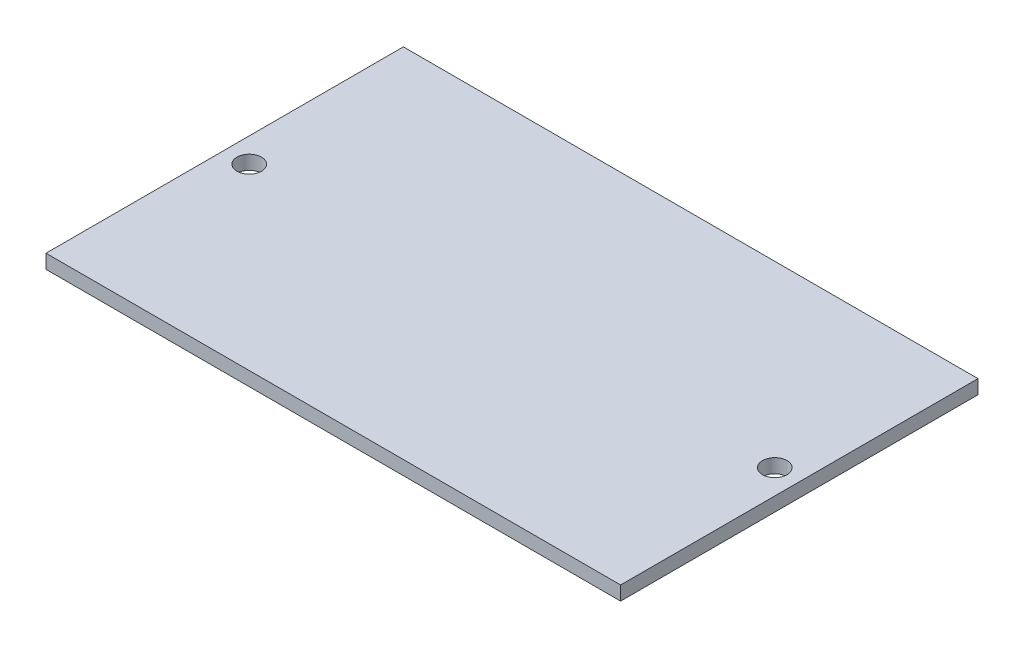
ISO-10303-21;
HEADER;
FILE_DESCRIPTION(('STEP AP214'),'2;1');
FILE_NAME('part.step','',(''),(''),'','','');
FILE_SCHEMA(('AUTOMOTIVE_DESIGN { 1 0 10303 214 1 1 1 1 }'));
ENDSEC;
DATA;
#1=APPLICATION_CONTEXT('core data for automotive mechanical design processes');
#2=APPLICATION_PROTOCOL_DEFINITION('international standard','automotive_design',2000,#1);
#3=PRODUCT_CONTEXT('',#1,'mechanical');
#4=PRODUCT('Part','Part','',(#3));
#5=PRODUCT_RELATED_PRODUCT_CATEGORY('part','',(#4));
#6=PRODUCT_DEFINITION_FORMATION('','',#4);
#7=PRODUCT_DEFINITION_CONTEXT('part definition',#1,'design');
#8=PRODUCT_DEFINITION('design','',#6,#7);
#9=PRODUCT_DEFINITION_SHAPE('','',#8);
#10=(LENGTH_UNIT() NAMED_UNIT(*) SI_UNIT(.MILLI.,.METRE.));
#11=(NAMED_UNIT(*) PLANE_ANGLE_UNIT() SI_UNIT($,.RADIAN.));
#12=(NAMED_UNIT(*) SI_UNIT($,.STERADIAN.) SOLID_ANGLE_UNIT());
#13=UNCERTAINTY_MEASURE_WITH_UNIT(LENGTH_MEASURE(1.E-05),#10,'distance_accuracy_value','');
#14=(GEOMETRIC_REPRESENTATION_CONTEXT(3) GLOBAL_UNCERTAINTY_ASSIGNED_CONTEXT((#13)) GLOBAL_UNIT_ASSIGNED_CONTEXT((#10,
#11,#12)) REPRESENTATION_CONTEXT('',''));
#15=CARTESIAN_POINT('',(0.,0.,0.));
#16=DIRECTION('',(0.,0.,1.));
#17=DIRECTION('',(1.,0.,0.));
#18=AXIS2_PLACEMENT_3D('',#15,#16,#17);
#19=CARTESIAN_POINT('',(0.,2.,0.));
#20=DIRECTION('',(1.,0.,0.));
#21=DIRECTION('',(0.,0.,-1.));
#22=AXIS2_PLACEMENT_3D('',#19,#20,#21);
#23=PLANE('',#22);
#24=DIRECTION('',(0.,0.,1.));
#25=VECTOR('',#24,1.);
#26=CARTESIAN_POINT('',(0.,0.,0.));
#27=LINE('',#26,#25);
#28=CARTESIAN_POINT('',(0.,0.,-51.));
#29=VERTEX_POINT('',#28);
#30=CARTESIAN_POINT('',(0.,0.,0.));
#31=VERTEX_POINT('',#30);
#32=EDGE_CURVE('E100',#29,#31,#27,.T.);
#33=ORIENTED_EDGE('',*,*,#32,.T.);
#34=DIRECTION('',(0.,-1.,0.));
#35=VECTOR('',#34,1.);
#36=CARTESIAN_POINT('',(0.,2.,0.));
#37=LINE('',#36,#35);
#38=CARTESIAN_POINT('',(0.,2.,0.));
#39=VERTEX_POINT('',#38);
#40=EDGE_CURVE('E11',#39,#31,#37,.T.);
#41=ORIENTED_EDGE('',*,*,#40,.F.);
#42=DIRECTION('',(0.,0.,1.));
#43=VECTOR('',#42,1.);
#44=CARTESIAN_POINT('',(0.,2.,0.));
#45=LINE('',#44,#43);
#46=CARTESIAN_POINT('',(0.,2.,-51.));
#47=VERTEX_POINT('',#46);
#48=EDGE_CURVE('E88',#47,#39,#45,.T.);
#49=ORIENTED_EDGE('',*,*,#48,.F.);
#50=DIRECTION('',(0.,-1.,0.));
#51=VECTOR('',#50,1.);
#52=CARTESIAN_POINT('',(0.,2.,-51.));
#53=LINE('',#52,#51);
#54=EDGE_CURVE('E96',#47,#29,#53,.T.);
#55=ORIENTED_EDGE('',*,*,#54,.T.);
#56=EDGE_LOOP('',(#33,#41,#49,#55));
#57=FACE_BOUND('',#56,.T.);
#58=ADVANCED_FACE('F37',(#57),#23,.F.);
#59=CARTESIAN_POINT('',(0.,2.,0.));
#60=DIRECTION('',(0.,0.,-1.));
#61=DIRECTION('',(-1.,0.,0.));
#62=AXIS2_PLACEMENT_3D('',#59,#60,#61);
#63=PLANE('',#62);
#64=DIRECTION('',(1.,0.,0.));
#65=VECTOR('',#64,1.);
#66=CARTESIAN_POINT('',(0.,0.,0.));
#67=LINE('',#66,#65);
#68=CARTESIAN_POINT('',(82.,0.,0.));
#69=VERTEX_POINT('',#68);
#70=EDGE_CURVE('E92',#31,#69,#67,.T.);
#71=ORIENTED_EDGE('',*,*,#70,.T.);
#72=DIRECTION('',(0.,-1.,0.));
#73=VECTOR('',#72,1.);
#74=CARTESIAN_POINT('',(82.,2.,0.));
#75=LINE('',#74,#73);
#76=CARTESIAN_POINT('',(82.,2.,0.));
#77=VERTEX_POINT('',#76);
#78=EDGE_CURVE('E45',#77,#69,#75,.T.);
#79=ORIENTED_EDGE('',*,*,#78,.F.);
#80=DIRECTION('',(1.,0.,0.));
#81=VECTOR('',#80,1.);
#82=CARTESIAN_POINT('',(0.,2.,0.));
#83=LINE('',#82,#81);
#84=EDGE_CURVE('E83',#39,#77,#83,.T.);
#85=ORIENTED_EDGE('',*,*,#84,.F.);
#86=ORIENTED_EDGE('',*,*,#40,.T.);
#87=EDGE_LOOP('',(#71,#79,#85,#86));
#88=FACE_BOUND('',#87,.T.);
#89=ADVANCED_FACE('F91',(#88),#63,.F.);
#90=CARTESIAN_POINT('',(82.,2.,0.));
#91=DIRECTION('',(-1.,0.,0.));
#92=DIRECTION('',(0.,0.,1.));
#93=AXIS2_PLACEMENT_3D('',#90,#91,#92);
#94=PLANE('',#93);
#95=DIRECTION('',(0.,0.,-1.));
#96=VECTOR('',#95,1.);
#97=CARTESIAN_POINT('',(82.,0.,0.));
#98=LINE('',#97,#96);
#99=CARTESIAN_POINT('',(82.,0.,-51.));
#100=VERTEX_POINT('',#99);
#101=EDGE_CURVE('E70',#69,#100,#98,.T.);
#102=ORIENTED_EDGE('',*,*,#101,.T.);
#103=DIRECTION('',(0.,-1.,0.));
#104=VECTOR('',#103,1.);
#105=CARTESIAN_POINT('',(82.,2.,-51.));
#106=LINE('',#105,#104);
#107=CARTESIAN_POINT('',(82.,2.,-51.));
#108=VERTEX_POINT('',#107);
#109=EDGE_CURVE('E93',#108,#100,#106,.T.);
#110=ORIENTED_EDGE('',*,*,#109,.F.);
#111=DIRECTION('',(0.,0.,-1.));
#112=VECTOR('',#111,1.);
#113=CARTESIAN_POINT('',(82.,2.,0.));
#114=LINE('',#113,#112);
#115=EDGE_CURVE('E86',#77,#108,#114,.T.);
#116=ORIENTED_EDGE('',*,*,#115,.F.);
#117=ORIENTED_EDGE('',*,*,#78,.T.);
#118=EDGE_LOOP('',(#102,#110,#116,#117));
#119=FACE_BOUND('',#118,.T.);
#120=ADVANCED_FACE('F94',(#119),#94,.F.);
#121=CARTESIAN_POINT('',(0.,2.,-51.));
#122=DIRECTION('',(0.,0.,1.));
#123=DIRECTION('',(1.,0.,0.));
#124=AXIS2_PLACEMENT_3D('',#121,#122,#123);
#125=PLANE('',#124);
#126=DIRECTION('',(-1.,0.,0.));
#127=VECTOR('',#126,1.);
#128=CARTESIAN_POINT('',(0.,0.,-51.));
#129=LINE('',#128,#127);
#130=EDGE_CURVE('E76',#100,#29,#129,.T.);
#131=ORIENTED_EDGE('',*,*,#130,.T.);
#132=ORIENTED_EDGE('',*,*,#54,.F.);
#133=DIRECTION('',(-1.,0.,0.));
#134=VECTOR('',#133,1.);
#135=CARTESIAN_POINT('',(0.,2.,-51.));
#136=LINE('',#135,#134);
#137=EDGE_CURVE('E53',#108,#47,#136,.T.);
#138=ORIENTED_EDGE('',*,*,#137,.F.);
#139=ORIENTED_EDGE('',*,*,#109,.T.);
#140=EDGE_LOOP('',(#131,#132,#138,#139));
#141=FACE_BOUND('',#140,.T.);
#142=ADVANCED_FACE('F108',(#141),#125,.F.);
#143=CARTESIAN_POINT('',(0.,2.,0.));
#144=DIRECTION('',(0.,-1.,0.));
#145=DIRECTION('',(0.,0.,-1.));
#146=AXIS2_PLACEMENT_3D('',#143,#144,#145);
#147=PLANE('',#146);
#148=CARTESIAN_POINT('',(3.5,2.,-25.5));
#149=DIRECTION('',(0.,1.,0.));
#150=DIRECTION('',(0.,0.,1.));
#151=AXIS2_PLACEMENT_3D('',#148,#149,#150);
#152=CIRCLE('',#151,1.75);
#153=CARTESIAN_POINT('',(3.5,2.,-23.75));
#154=VERTEX_POINT('',#153);
#155=EDGE_CURVE('E120',#154,#154,#152,.T.);
#156=ORIENTED_EDGE('',*,*,#155,.F.);
#157=EDGE_LOOP('',(#156));
#158=FACE_BOUND('',#157,.T.);
#159=CARTESIAN_POINT('',(78.5,2.,-25.5));
#160=DIRECTION('',(0.,1.,0.));
#161=DIRECTION('',(0.,0.,1.));
#162=AXIS2_PLACEMENT_3D('',#159,#160,#161);
#163=CIRCLE('',#162,1.75);
#164=CARTESIAN_POINT('',(78.5,2.,-23.75));
#165=VERTEX_POINT('',#164);
#166=EDGE_CURVE('E117',#165,#165,#163,.T.);
#167=ORIENTED_EDGE('',*,*,#166,.F.);
#168=EDGE_LOOP('',(#167));
#169=FACE_BOUND('',#168,.T.);
#170=ORIENTED_EDGE('',*,*,#48,.T.);
#171=ORIENTED_EDGE('',*,*,#84,.T.);
#172=ORIENTED_EDGE('',*,*,#115,.T.);
#173=ORIENTED_EDGE('',*,*,#137,.T.);
#174=EDGE_LOOP('',(#170,#171,#172,#173));
#175=FACE_BOUND('',#174,.T.);
#176=ADVANCED_FACE('F84',(#158,#169,#175),#147,.F.);
#177=CARTESIAN_POINT('',(0.,0.,0.));
#178=DIRECTION('',(0.,-1.,0.));
#179=DIRECTION('',(0.,0.,-1.));
#180=AXIS2_PLACEMENT_3D('',#177,#178,#179);
#181=PLANE('',#180);
#182=CARTESIAN_POINT('',(3.5,0.,-25.5));
#183=DIRECTION('',(0.,1.,0.));
#184=DIRECTION('',(0.,0.,1.));
#185=AXIS2_PLACEMENT_3D('',#182,#183,#184);
#186=CIRCLE('',#185,1.75);
#187=CARTESIAN_POINT('',(3.5,0.,-23.75));
#188=VERTEX_POINT('',#187);
#189=EDGE_CURVE('E103',#188,#188,#186,.T.);
#190=ORIENTED_EDGE('',*,*,#189,.T.);
#191=EDGE_LOOP('',(#190));
#192=FACE_BOUND('',#191,.T.);
#193=CARTESIAN_POINT('',(78.5,0.,-25.5));
#194=DIRECTION('',(0.,1.,0.));
#195=DIRECTION('',(0.,0.,1.));
#196=AXIS2_PLACEMENT_3D('',#193,#194,#195);
#197=CIRCLE('',#196,1.75);
#198=CARTESIAN_POINT('',(78.5,0.,-23.75));
#199=VERTEX_POINT('',#198);
#200=EDGE_CURVE('E114',#199,#199,#197,.T.);
#201=ORIENTED_EDGE('',*,*,#200,.T.);
#202=EDGE_LOOP('',(#201));
#203=FACE_BOUND('',#202,.T.);
#204=ORIENTED_EDGE('',*,*,#32,.F.);
#205=ORIENTED_EDGE('',*,*,#130,.F.);
#206=ORIENTED_EDGE('',*,*,#101,.F.);
#207=ORIENTED_EDGE('',*,*,#70,.F.);
#208=EDGE_LOOP('',(#204,#205,#206,#207));
#209=FACE_BOUND('',#208,.T.);
#210=ADVANCED_FACE('F111',(#192,#203,#209),#181,.T.);
#211=CARTESIAN_POINT('',(78.5,0.,-25.5));
#212=DIRECTION('',(0.,1.,0.));
#213=DIRECTION('',(0.,0.,1.));
#214=AXIS2_PLACEMENT_3D('',#211,#212,#213);
#215=CYLINDRICAL_SURFACE('',#214,1.75);
#216=ORIENTED_EDGE('',*,*,#200,.F.);
#217=EDGE_LOOP('',(#216));
#218=FACE_BOUND('',#217,.T.);
#219=ORIENTED_EDGE('',*,*,#166,.T.);
#220=EDGE_LOOP('',(#219));
#221=FACE_BOUND('',#220,.T.);
#222=ADVANCED_FACE('F131',(#218,#221),#215,.F.);
#223=CARTESIAN_POINT('',(3.5,0.,-25.5));
#224=DIRECTION('',(0.,1.,0.));
#225=DIRECTION('',(0.,0.,1.));
#226=AXIS2_PLACEMENT_3D('',#223,#224,#225);
#227=CYLINDRICAL_SURFACE('',#226,1.75);
#228=ORIENTED_EDGE('',*,*,#189,.F.);
#229=EDGE_LOOP('',(#228));
#230=FACE_BOUND('',#229,.T.);
#231=ORIENTED_EDGE('',*,*,#155,.T.);
#232=EDGE_LOOP('',(#231));
#233=FACE_BOUND('',#232,.T.);
#234=ADVANCED_FACE('F128',(#230,#233),#227,.F.);
#235=CLOSED_SHELL('',(#58,#89,#120,#142,#176,#210,#222,#234));
#236=MANIFOLD_SOLID_BREP('B2',#235);
#237=ADVANCED_BREP_SHAPE_REPRESENTATION('',(#18,#236),#14);
#238=SHAPE_DEFINITION_REPRESENTATION(#9,#237);
ENDSEC;
END-ISO-10303-21;
